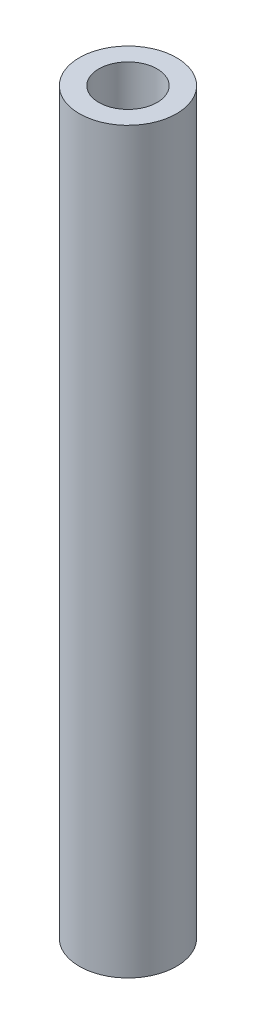
ISO-10303-21;
HEADER;
FILE_DESCRIPTION(('STEP AP214'),'2;1');
FILE_NAME('part.step','',(''),(''),'','','');
FILE_SCHEMA(('AUTOMOTIVE_DESIGN { 1 0 10303 214 1 1 1 1 }'));
ENDSEC;
DATA;
#1=APPLICATION_CONTEXT('core data for automotive mechanical design processes');
#2=APPLICATION_PROTOCOL_DEFINITION('international standard','automotive_design',2000,#1);
#3=PRODUCT_CONTEXT('',#1,'mechanical');
#4=PRODUCT('Part','Part','',(#3));
#5=PRODUCT_RELATED_PRODUCT_CATEGORY('part','',(#4));
#6=PRODUCT_DEFINITION_FORMATION('','',#4);
#7=PRODUCT_DEFINITION_CONTEXT('part definition',#1,'design');
#8=PRODUCT_DEFINITION('design','',#6,#7);
#9=PRODUCT_DEFINITION_SHAPE('','',#8);
#10=(LENGTH_UNIT() NAMED_UNIT(*) SI_UNIT(.MILLI.,.METRE.));
#11=(NAMED_UNIT(*) PLANE_ANGLE_UNIT() SI_UNIT($,.RADIAN.));
#12=(NAMED_UNIT(*) SI_UNIT($,.STERADIAN.) SOLID_ANGLE_UNIT());
#13=UNCERTAINTY_MEASURE_WITH_UNIT(LENGTH_MEASURE(1.E-05),#10,'distance_accuracy_value','');
#14=(GEOMETRIC_REPRESENTATION_CONTEXT(3) GLOBAL_UNCERTAINTY_ASSIGNED_CONTEXT((#13)) GLOBAL_UNIT_ASSIGNED_CONTEXT((#10,
#11,#12)) REPRESENTATION_CONTEXT('',''));
#15=CARTESIAN_POINT('',(0.,0.,0.));
#16=DIRECTION('',(0.,0.,1.));
#17=DIRECTION('',(1.,0.,0.));
#18=AXIS2_PLACEMENT_3D('',#15,#16,#17);
#19=CARTESIAN_POINT('',(0.,19.,0.));
#20=DIRECTION('',(0.,1.,0.));
#21=DIRECTION('',(0.,0.,1.));
#22=AXIS2_PLACEMENT_3D('',#19,#20,#21);
#23=PLANE('',#22);
#24=CARTESIAN_POINT('',(0.,19.,0.));
#25=DIRECTION('',(0.,1.,0.));
#26=DIRECTION('',(0.,0.,1.));
#27=AXIS2_PLACEMENT_3D('',#24,#25,#26);
#28=CIRCLE('',#27,2.5);
#29=CARTESIAN_POINT('',(0.,19.,2.5));
#30=VERTEX_POINT('',#29);
#31=EDGE_CURVE('E10',#30,#30,#28,.T.);
#32=ORIENTED_EDGE('',*,*,#31,.T.);
#33=EDGE_LOOP('',(#32));
#34=FACE_BOUND('',#33,.T.);
#35=CARTESIAN_POINT('',(0.,19.,0.));
#36=DIRECTION('',(0.,1.,0.));
#37=DIRECTION('',(0.,0.,1.));
#38=AXIS2_PLACEMENT_3D('',#35,#36,#37);
#39=CIRCLE('',#38,1.5);
#40=CARTESIAN_POINT('',(0.,19.,1.5));
#41=VERTEX_POINT('',#40);
#42=EDGE_CURVE('E51',#41,#41,#39,.T.);
#43=ORIENTED_EDGE('',*,*,#42,.F.);
#44=EDGE_LOOP('',(#43));
#45=FACE_BOUND('',#44,.T.);
#46=ADVANCED_FACE('F36',(#34,#45),#23,.T.);
#47=CARTESIAN_POINT('',(0.,-19.,0.));
#48=DIRECTION('',(0.,1.,0.));
#49=DIRECTION('',(0.,0.,1.));
#50=AXIS2_PLACEMENT_3D('',#47,#48,#49);
#51=PLANE('',#50);
#52=CARTESIAN_POINT('',(0.,-19.,0.));
#53=DIRECTION('',(0.,1.,0.));
#54=DIRECTION('',(0.,0.,1.));
#55=AXIS2_PLACEMENT_3D('',#52,#53,#54);
#56=CIRCLE('',#55,2.5);
#57=CARTESIAN_POINT('',(0.,-19.,2.5));
#58=VERTEX_POINT('',#57);
#59=EDGE_CURVE('E40',#58,#58,#56,.T.);
#60=ORIENTED_EDGE('',*,*,#59,.F.);
#61=EDGE_LOOP('',(#60));
#62=FACE_BOUND('',#61,.T.);
#63=CARTESIAN_POINT('',(0.,-19.,0.));
#64=DIRECTION('',(0.,1.,0.));
#65=DIRECTION('',(0.,0.,1.));
#66=AXIS2_PLACEMENT_3D('',#63,#64,#65);
#67=CIRCLE('',#66,1.5);
#68=CARTESIAN_POINT('',(0.,-19.,1.5));
#69=VERTEX_POINT('',#68);
#70=EDGE_CURVE('E53',#69,#69,#67,.T.);
#71=ORIENTED_EDGE('',*,*,#70,.T.);
#72=EDGE_LOOP('',(#71));
#73=FACE_BOUND('',#72,.T.);
#74=ADVANCED_FACE('F63',(#62,#73),#51,.F.);
#75=CARTESIAN_POINT('',(0.,19.,0.));
#76=DIRECTION('',(0.,-1.,0.));
#77=DIRECTION('',(0.,0.,-1.));
#78=AXIS2_PLACEMENT_3D('',#75,#76,#77);
#79=CYLINDRICAL_SURFACE('',#78,2.5);
#80=ORIENTED_EDGE('',*,*,#31,.F.);
#81=EDGE_LOOP('',(#80));
#82=FACE_BOUND('',#81,.T.);
#83=ORIENTED_EDGE('',*,*,#59,.T.);
#84=EDGE_LOOP('',(#83));
#85=FACE_BOUND('',#84,.T.);
#86=ADVANCED_FACE('F38',(#82,#85),#79,.T.);
#87=CARTESIAN_POINT('',(0.,19.,0.));
#88=DIRECTION('',(0.,-1.,0.));
#89=DIRECTION('',(0.,0.,-1.));
#90=AXIS2_PLACEMENT_3D('',#87,#88,#89);
#91=CYLINDRICAL_SURFACE('',#90,1.5);
#92=ORIENTED_EDGE('',*,*,#42,.T.);
#93=EDGE_LOOP('',(#92));
#94=FACE_BOUND('',#93,.T.);
#95=ORIENTED_EDGE('',*,*,#70,.F.);
#96=EDGE_LOOP('',(#95));
#97=FACE_BOUND('',#96,.T.);
#98=ADVANCED_FACE('F59',(#94,#97),#91,.F.);
#99=CLOSED_SHELL('',(#46,#74,#86,#98));
#100=MANIFOLD_SOLID_BREP('B2',#99);
#101=ADVANCED_BREP_SHAPE_REPRESENTATION('',(#18,#100),#14);
#102=SHAPE_DEFINITION_REPRESENTATION(#9,#101);
ENDSEC;
END-ISO-10303-21;
